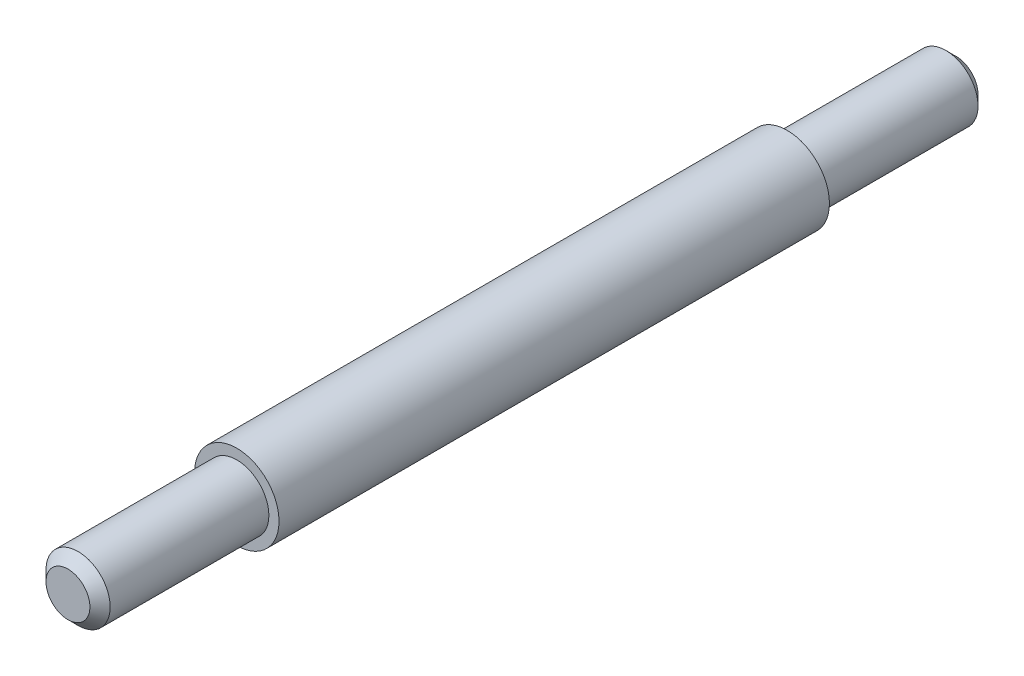
ISO-10303-21;
HEADER;
FILE_DESCRIPTION(('STEP AP214'),'2;1');
FILE_NAME('part.step','',(''),(''),'','','');
FILE_SCHEMA(('AUTOMOTIVE_DESIGN { 1 0 10303 214 1 1 1 1 }'));
ENDSEC;
DATA;
#1=APPLICATION_CONTEXT('core data for automotive mechanical design processes');
#2=APPLICATION_PROTOCOL_DEFINITION('international standard','automotive_design',2000,#1);
#3=PRODUCT_CONTEXT('',#1,'mechanical');
#4=PRODUCT('Part','Part','',(#3));
#5=PRODUCT_RELATED_PRODUCT_CATEGORY('part','',(#4));
#6=PRODUCT_DEFINITION_FORMATION('','',#4);
#7=PRODUCT_DEFINITION_CONTEXT('part definition',#1,'design');
#8=PRODUCT_DEFINITION('design','',#6,#7);
#9=PRODUCT_DEFINITION_SHAPE('','',#8);
#10=(LENGTH_UNIT() NAMED_UNIT(*) SI_UNIT(.MILLI.,.METRE.));
#11=(NAMED_UNIT(*) PLANE_ANGLE_UNIT() SI_UNIT($,.RADIAN.));
#12=(NAMED_UNIT(*) SI_UNIT($,.STERADIAN.) SOLID_ANGLE_UNIT());
#13=UNCERTAINTY_MEASURE_WITH_UNIT(LENGTH_MEASURE(1.E-05),#10,'distance_accuracy_value','');
#14=(GEOMETRIC_REPRESENTATION_CONTEXT(3) GLOBAL_UNCERTAINTY_ASSIGNED_CONTEXT((#13)) GLOBAL_UNIT_ASSIGNED_CONTEXT((#10,
#11,#12)) REPRESENTATION_CONTEXT('',''));
#15=CARTESIAN_POINT('',(0.,0.,0.));
#16=DIRECTION('',(0.,0.,1.));
#17=DIRECTION('',(1.,0.,0.));
#18=AXIS2_PLACEMENT_3D('',#15,#16,#17);
#19=CARTESIAN_POINT('',(0.,0.,0.));
#20=DIRECTION('',(0.,0.,1.));
#21=DIRECTION('',(1.,0.,0.));
#22=AXIS2_PLACEMENT_3D('',#19,#20,#21);
#23=PLANE('',#22);
#24=CARTESIAN_POINT('',(0.,0.,0.));
#25=DIRECTION('',(0.,0.,1.));
#26=DIRECTION('',(1.,0.,0.));
#27=AXIS2_PLACEMENT_3D('',#24,#25,#26);
#28=CIRCLE('',#27,0.0650000000000002);
#29=CARTESIAN_POINT('',(0.0650000000000002,0.,0.));
#30=VERTEX_POINT('',#29);
#31=EDGE_CURVE('E45',#30,#30,#28,.T.);
#32=ORIENTED_EDGE('',*,*,#31,.T.);
#33=EDGE_LOOP('',(#32));
#34=FACE_BOUND('',#33,.T.);
#35=ADVANCED_FACE('F37',(#34),#23,.T.);
#36=CARTESIAN_POINT('',(0.,0.,0.));
#37=DIRECTION('',(0.,0.,1.));
#38=DIRECTION('',(1.,0.,0.));
#39=AXIS2_PLACEMENT_3D('',#36,#37,#38);
#40=CYLINDRICAL_SURFACE('',#39,0.095);
#41=CARTESIAN_POINT('',(0.,0.,-0.0299999999999998));
#42=DIRECTION('',(0.,0.,1.));
#43=DIRECTION('',(1.,0.,0.));
#44=AXIS2_PLACEMENT_3D('',#41,#42,#43);
#45=CIRCLE('',#44,0.095);
#46=CARTESIAN_POINT('',(0.095,0.,-0.0299999999999998));
#47=VERTEX_POINT('',#46);
#48=EDGE_CURVE('E10',#47,#47,#45,.F.);
#49=ORIENTED_EDGE('',*,*,#48,.T.);
#50=EDGE_LOOP('',(#49));
#51=FACE_BOUND('',#50,.T.);
#52=CARTESIAN_POINT('',(0.,0.,-0.5));
#53=DIRECTION('',(0.,0.,1.));
#54=DIRECTION('',(1.,0.,0.));
#55=AXIS2_PLACEMENT_3D('',#52,#53,#54);
#56=CIRCLE('',#55,0.095);
#57=CARTESIAN_POINT('',(0.095,0.,-0.5));
#58=VERTEX_POINT('',#57);
#59=EDGE_CURVE('E58',#58,#58,#56,.T.);
#60=ORIENTED_EDGE('',*,*,#59,.T.);
#61=EDGE_LOOP('',(#60));
#62=FACE_BOUND('',#61,.T.);
#63=ADVANCED_FACE('F89',(#51,#62),#40,.T.);
#64=CARTESIAN_POINT('',(0.095,0.,-0.5));
#65=DIRECTION('',(0.,0.,1.));
#66=DIRECTION('',(1.,0.,0.));
#67=AXIS2_PLACEMENT_3D('',#64,#65,#66);
#68=PLANE('',#67);
#69=CARTESIAN_POINT('',(0.,0.,-0.5));
#70=DIRECTION('',(0.,0.,1.));
#71=DIRECTION('',(1.,0.,0.));
#72=AXIS2_PLACEMENT_3D('',#69,#70,#71);
#73=CIRCLE('',#72,0.125);
#74=CARTESIAN_POINT('',(0.125,0.,-0.5));
#75=VERTEX_POINT('',#74);
#76=EDGE_CURVE('E61',#75,#75,#73,.T.);
#77=ORIENTED_EDGE('',*,*,#76,.T.);
#78=EDGE_LOOP('',(#77));
#79=FACE_BOUND('',#78,.T.);
#80=ORIENTED_EDGE('',*,*,#59,.F.);
#81=EDGE_LOOP('',(#80));
#82=FACE_BOUND('',#81,.T.);
#83=ADVANCED_FACE('F94',(#79,#82),#68,.T.);
#84=CARTESIAN_POINT('',(0.,0.,0.));
#85=DIRECTION('',(0.,0.,1.));
#86=DIRECTION('',(1.,0.,0.));
#87=AXIS2_PLACEMENT_3D('',#84,#85,#86);
#88=CYLINDRICAL_SURFACE('',#87,0.125);
#89=CARTESIAN_POINT('',(0.,0.,-2.13));
#90=DIRECTION('',(0.,0.,1.));
#91=DIRECTION('',(1.,0.,0.));
#92=AXIS2_PLACEMENT_3D('',#89,#90,#91);
#93=CIRCLE('',#92,0.125);
#94=CARTESIAN_POINT('',(0.125,0.,-2.13));
#95=VERTEX_POINT('',#94);
#96=EDGE_CURVE('E64',#95,#95,#93,.T.);
#97=ORIENTED_EDGE('',*,*,#96,.T.);
#98=EDGE_LOOP('',(#97));
#99=FACE_BOUND('',#98,.T.);
#100=ORIENTED_EDGE('',*,*,#76,.F.);
#101=EDGE_LOOP('',(#100));
#102=FACE_BOUND('',#101,.T.);
#103=ADVANCED_FACE('F86',(#99,#102),#88,.T.);
#104=CARTESIAN_POINT('',(0.125,0.,-2.13));
#105=DIRECTION('',(0.,0.,-1.));
#106=DIRECTION('',(-1.,0.,0.));
#107=AXIS2_PLACEMENT_3D('',#104,#105,#106);
#108=PLANE('',#107);
#109=CARTESIAN_POINT('',(0.,0.,-2.13));
#110=DIRECTION('',(0.,0.,1.));
#111=DIRECTION('',(1.,0.,0.));
#112=AXIS2_PLACEMENT_3D('',#109,#110,#111);
#113=CIRCLE('',#112,0.095);
#114=CARTESIAN_POINT('',(0.095,0.,-2.13));
#115=VERTEX_POINT('',#114);
#116=EDGE_CURVE('E67',#115,#115,#113,.T.);
#117=ORIENTED_EDGE('',*,*,#116,.T.);
#118=EDGE_LOOP('',(#117));
#119=FACE_BOUND('',#118,.T.);
#120=ORIENTED_EDGE('',*,*,#96,.F.);
#121=EDGE_LOOP('',(#120));
#122=FACE_BOUND('',#121,.T.);
#123=ADVANCED_FACE('F71',(#119,#122),#108,.T.);
#124=CARTESIAN_POINT('',(0.,0.,0.));
#125=DIRECTION('',(0.,0.,1.));
#126=DIRECTION('',(1.,0.,0.));
#127=AXIS2_PLACEMENT_3D('',#124,#125,#126);
#128=CYLINDRICAL_SURFACE('',#127,0.095);
#129=CARTESIAN_POINT('',(0.,0.,-2.6));
#130=DIRECTION('',(0.,0.,-1.));
#131=DIRECTION('',(-1.,0.,0.));
#132=AXIS2_PLACEMENT_3D('',#129,#130,#131);
#133=CIRCLE('',#132,0.095);
#134=CARTESIAN_POINT('',(-0.095,0.,-2.6));
#135=VERTEX_POINT('',#134);
#136=EDGE_CURVE('E53',#135,#135,#133,.F.);
#137=ORIENTED_EDGE('',*,*,#136,.T.);
#138=EDGE_LOOP('',(#137));
#139=FACE_BOUND('',#138,.T.);
#140=ORIENTED_EDGE('',*,*,#116,.F.);
#141=EDGE_LOOP('',(#140));
#142=FACE_BOUND('',#141,.T.);
#143=ADVANCED_FACE('F74',(#139,#142),#128,.T.);
#144=CARTESIAN_POINT('',(0.095,0.,-2.63));
#145=DIRECTION('',(0.,0.,-1.));
#146=DIRECTION('',(-1.,0.,0.));
#147=AXIS2_PLACEMENT_3D('',#144,#145,#146);
#148=PLANE('',#147);
#149=CARTESIAN_POINT('',(0.,0.,-2.63));
#150=DIRECTION('',(0.,0.,-1.));
#151=DIRECTION('',(-1.,0.,0.));
#152=AXIS2_PLACEMENT_3D('',#149,#150,#151);
#153=CIRCLE('',#152,0.0649999999999995);
#154=CARTESIAN_POINT('',(-0.0649999999999995,0.,-2.63));
#155=VERTEX_POINT('',#154);
#156=EDGE_CURVE('E49',#155,#155,#153,.T.);
#157=ORIENTED_EDGE('',*,*,#156,.T.);
#158=EDGE_LOOP('',(#157));
#159=FACE_BOUND('',#158,.T.);
#160=ADVANCED_FACE('F76',(#159),#148,.T.);
#161=CARTESIAN_POINT('',(0.,0.,-2.6));
#162=DIRECTION('',(0.,0.,1.));
#163=DIRECTION('',(1.,0.,0.));
#164=AXIS2_PLACEMENT_3D('',#161,#162,#163);
#165=CONICAL_SURFACE('',#164,0.095,0.785398163397448);
#166=ORIENTED_EDGE('',*,*,#156,.F.);
#167=EDGE_LOOP('',(#166));
#168=FACE_BOUND('',#167,.T.);
#169=ORIENTED_EDGE('',*,*,#136,.F.);
#170=EDGE_LOOP('',(#169));
#171=FACE_BOUND('',#170,.T.);
#172=ADVANCED_FACE('F83',(#168,#171),#165,.T.);
#173=CARTESIAN_POINT('',(0.,0.,0.));
#174=DIRECTION('',(0.,0.,-1.));
#175=DIRECTION('',(-1.,0.,0.));
#176=AXIS2_PLACEMENT_3D('',#173,#174,#175);
#177=CONICAL_SURFACE('',#176,0.0650000000000002,0.785398163397448);
#178=ORIENTED_EDGE('',*,*,#48,.F.);
#179=EDGE_LOOP('',(#178));
#180=FACE_BOUND('',#179,.T.);
#181=ORIENTED_EDGE('',*,*,#31,.F.);
#182=EDGE_LOOP('',(#181));
#183=FACE_BOUND('',#182,.T.);
#184=ADVANCED_FACE('F40',(#180,#183),#177,.T.);
#185=CLOSED_SHELL('',(#35,#63,#83,#103,#123,#143,#160,#172,#184));
#186=MANIFOLD_SOLID_BREP('B2',#185);
#187=ADVANCED_BREP_SHAPE_REPRESENTATION('',(#18,#186),#14);
#188=SHAPE_DEFINITION_REPRESENTATION(#9,#187);
ENDSEC;
END-ISO-10303-21;
